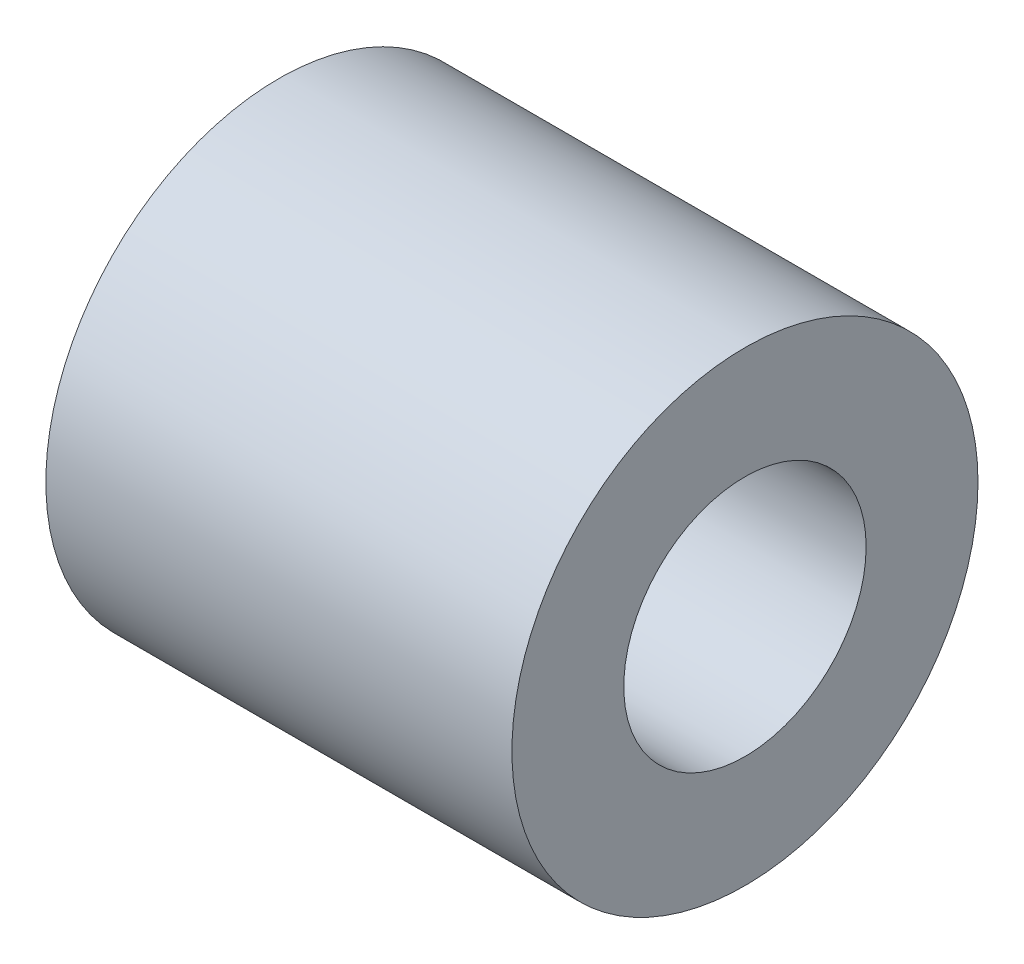
ISO-10303-21;
HEADER;
FILE_DESCRIPTION(('STEP AP214'),'2;1');
FILE_NAME('part.step','',(''),(''),'','','');
FILE_SCHEMA(('AUTOMOTIVE_DESIGN { 1 0 10303 214 1 1 1 1 }'));
ENDSEC;
DATA;
#1=APPLICATION_CONTEXT('core data for automotive mechanical design processes');
#2=APPLICATION_PROTOCOL_DEFINITION('international standard','automotive_design',2000,#1);
#3=PRODUCT_CONTEXT('',#1,'mechanical');
#4=PRODUCT('Part','Part','',(#3));
#5=PRODUCT_RELATED_PRODUCT_CATEGORY('part','',(#4));
#6=PRODUCT_DEFINITION_FORMATION('','',#4);
#7=PRODUCT_DEFINITION_CONTEXT('part definition',#1,'design');
#8=PRODUCT_DEFINITION('design','',#6,#7);
#9=PRODUCT_DEFINITION_SHAPE('','',#8);
#10=(LENGTH_UNIT() NAMED_UNIT(*) SI_UNIT(.MILLI.,.METRE.));
#11=(NAMED_UNIT(*) PLANE_ANGLE_UNIT() SI_UNIT($,.RADIAN.));
#12=(NAMED_UNIT(*) SI_UNIT($,.STERADIAN.) SOLID_ANGLE_UNIT());
#13=UNCERTAINTY_MEASURE_WITH_UNIT(LENGTH_MEASURE(1.E-05),#10,'distance_accuracy_value','');
#14=(GEOMETRIC_REPRESENTATION_CONTEXT(3) GLOBAL_UNCERTAINTY_ASSIGNED_CONTEXT((#13)) GLOBAL_UNIT_ASSIGNED_CONTEXT((#10,
#11,#12)) REPRESENTATION_CONTEXT('',''));
#15=CARTESIAN_POINT('',(0.,0.,0.));
#16=DIRECTION('',(0.,0.,1.));
#17=DIRECTION('',(1.,0.,0.));
#18=AXIS2_PLACEMENT_3D('',#15,#16,#17);
#19=CARTESIAN_POINT('',(6.35,0.,0.));
#20=DIRECTION('',(-1.,0.,0.));
#21=DIRECTION('',(0.,0.,1.));
#22=AXIS2_PLACEMENT_3D('',#19,#20,#21);
#23=CYLINDRICAL_SURFACE('',#22,3.175);
#24=CARTESIAN_POINT('',(6.35,0.,0.));
#25=DIRECTION('',(1.,0.,0.));
#26=DIRECTION('',(0.,0.,-1.));
#27=AXIS2_PLACEMENT_3D('',#24,#25,#26);
#28=CIRCLE('',#27,3.175);
#29=CARTESIAN_POINT('',(6.35,0.,-3.175));
#30=VERTEX_POINT('',#29);
#31=EDGE_CURVE('E10',#30,#30,#28,.T.);
#32=ORIENTED_EDGE('',*,*,#31,.F.);
#33=EDGE_LOOP('',(#32));
#34=FACE_BOUND('',#33,.T.);
#35=CARTESIAN_POINT('',(0.,0.,0.));
#36=DIRECTION('',(1.,0.,0.));
#37=DIRECTION('',(0.,0.,-1.));
#38=AXIS2_PLACEMENT_3D('',#35,#36,#37);
#39=CIRCLE('',#38,3.175);
#40=CARTESIAN_POINT('',(0.,0.,-3.175));
#41=VERTEX_POINT('',#40);
#42=EDGE_CURVE('E35',#41,#41,#39,.T.);
#43=ORIENTED_EDGE('',*,*,#42,.T.);
#44=EDGE_LOOP('',(#43));
#45=FACE_BOUND('',#44,.T.);
#46=ADVANCED_FACE('F32',(#34,#45),#23,.T.);
#47=CARTESIAN_POINT('',(6.35,0.,0.));
#48=DIRECTION('',(1.,0.,0.));
#49=DIRECTION('',(0.,0.,-1.));
#50=AXIS2_PLACEMENT_3D('',#47,#48,#49);
#51=PLANE('',#50);
#52=CARTESIAN_POINT('',(6.35,0.,0.));
#53=DIRECTION('',(1.,0.,0.));
#54=DIRECTION('',(0.,0.,-1.));
#55=AXIS2_PLACEMENT_3D('',#52,#53,#54);
#56=CIRCLE('',#55,1.651);
#57=CARTESIAN_POINT('',(6.35,0.,-1.651));
#58=VERTEX_POINT('',#57);
#59=EDGE_CURVE('E44',#58,#58,#56,.T.);
#60=ORIENTED_EDGE('',*,*,#59,.F.);
#61=EDGE_LOOP('',(#60));
#62=FACE_BOUND('',#61,.T.);
#63=ORIENTED_EDGE('',*,*,#31,.T.);
#64=EDGE_LOOP('',(#63));
#65=FACE_BOUND('',#64,.T.);
#66=ADVANCED_FACE('F59',(#62,#65),#51,.T.);
#67=CARTESIAN_POINT('',(0.,0.,0.));
#68=DIRECTION('',(1.,0.,0.));
#69=DIRECTION('',(0.,0.,-1.));
#70=AXIS2_PLACEMENT_3D('',#67,#68,#69);
#71=PLANE('',#70);
#72=CARTESIAN_POINT('',(0.,0.,0.));
#73=DIRECTION('',(1.,0.,0.));
#74=DIRECTION('',(0.,0.,-1.));
#75=AXIS2_PLACEMENT_3D('',#72,#73,#74);
#76=CIRCLE('',#75,1.651);
#77=CARTESIAN_POINT('',(0.,0.,-1.651));
#78=VERTEX_POINT('',#77);
#79=EDGE_CURVE('E42',#78,#78,#76,.T.);
#80=ORIENTED_EDGE('',*,*,#79,.T.);
#81=EDGE_LOOP('',(#80));
#82=FACE_BOUND('',#81,.T.);
#83=ORIENTED_EDGE('',*,*,#42,.F.);
#84=EDGE_LOOP('',(#83));
#85=FACE_BOUND('',#84,.T.);
#86=ADVANCED_FACE('F50',(#82,#85),#71,.F.);
#87=CARTESIAN_POINT('',(0.,0.,0.));
#88=DIRECTION('',(1.,0.,0.));
#89=DIRECTION('',(0.,0.,-1.));
#90=AXIS2_PLACEMENT_3D('',#87,#88,#89);
#91=CYLINDRICAL_SURFACE('',#90,1.651);
#92=ORIENTED_EDGE('',*,*,#79,.F.);
#93=EDGE_LOOP('',(#92));
#94=FACE_BOUND('',#93,.T.);
#95=ORIENTED_EDGE('',*,*,#59,.T.);
#96=EDGE_LOOP('',(#95));
#97=FACE_BOUND('',#96,.T.);
#98=ADVANCED_FACE('F53',(#94,#97),#91,.F.);
#99=CLOSED_SHELL('',(#46,#66,#86,#98));
#100=MANIFOLD_SOLID_BREP('B2',#99);
#101=ADVANCED_BREP_SHAPE_REPRESENTATION('',(#18,#100),#14);
#102=SHAPE_DEFINITION_REPRESENTATION(#9,#101);
ENDSEC;
END-ISO-10303-21;
